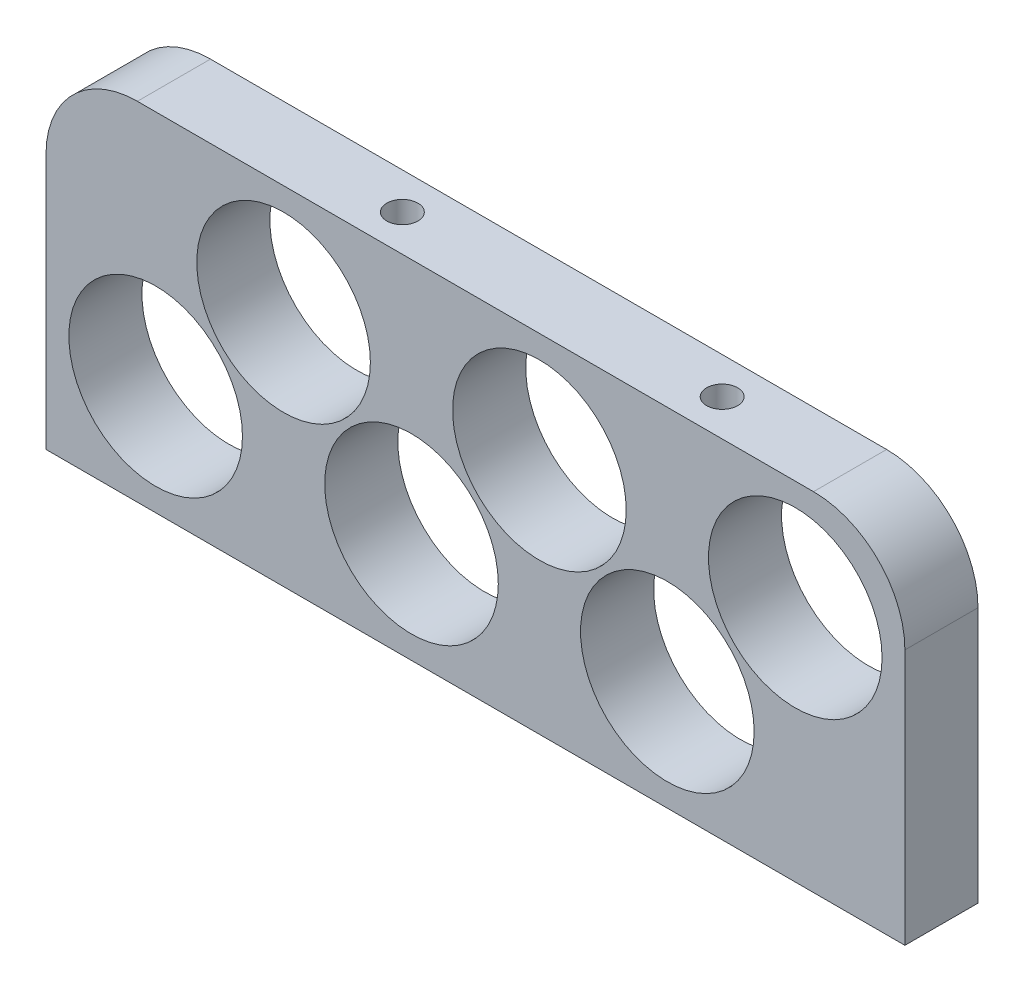
ISO-10303-21;
HEADER;
FILE_DESCRIPTION(('STEP AP214'),'2;1');
FILE_NAME('part.step','',(''),(''),'','','');
FILE_SCHEMA(('AUTOMOTIVE_DESIGN { 1 0 10303 214 1 1 1 1 }'));
ENDSEC;
DATA;
#1=APPLICATION_CONTEXT('core data for automotive mechanical design processes');
#2=APPLICATION_PROTOCOL_DEFINITION('international standard','automotive_design',2000,#1);
#3=PRODUCT_CONTEXT('',#1,'mechanical');
#4=PRODUCT('Part','Part','',(#3));
#5=PRODUCT_RELATED_PRODUCT_CATEGORY('part','',(#4));
#6=PRODUCT_DEFINITION_FORMATION('','',#4);
#7=PRODUCT_DEFINITION_CONTEXT('part definition',#1,'design');
#8=PRODUCT_DEFINITION('design','',#6,#7);
#9=PRODUCT_DEFINITION_SHAPE('','',#8);
#10=(LENGTH_UNIT() NAMED_UNIT(*) SI_UNIT(.MILLI.,.METRE.));
#11=(NAMED_UNIT(*) PLANE_ANGLE_UNIT() SI_UNIT($,.RADIAN.));
#12=(NAMED_UNIT(*) SI_UNIT($,.STERADIAN.) SOLID_ANGLE_UNIT());
#13=UNCERTAINTY_MEASURE_WITH_UNIT(LENGTH_MEASURE(1.E-05),#10,'distance_accuracy_value','');
#14=(GEOMETRIC_REPRESENTATION_CONTEXT(3) GLOBAL_UNCERTAINTY_ASSIGNED_CONTEXT((#13)) GLOBAL_UNIT_ASSIGNED_CONTEXT((#10,
#11,#12)) REPRESENTATION_CONTEXT('',''));
#15=CARTESIAN_POINT('',(0.,0.,0.));
#16=DIRECTION('',(0.,0.,1.));
#17=DIRECTION('',(1.,0.,0.));
#18=AXIS2_PLACEMENT_3D('',#15,#16,#17);
#19=CARTESIAN_POINT('',(0.,0.,8.));
#20=DIRECTION('',(0.,0.,1.));
#21=DIRECTION('',(1.,0.,0.));
#22=AXIS2_PLACEMENT_3D('',#19,#20,#21);
#23=PLANE('',#22);
#24=CARTESIAN_POINT('',(-116.821569614031,27.9917719312551,8.));
#25=DIRECTION('',(0.,0.,1.));
#26=DIRECTION('',(1.,0.,0.));
#27=AXIS2_PLACEMENT_3D('',#24,#25,#26);
#28=CIRCLE('',#27,9.49999999999999);
#29=CARTESIAN_POINT('',(-107.321569614031,27.9917719312551,8.));
#30=VERTEX_POINT('',#29);
#31=EDGE_CURVE('E199',#30,#30,#28,.T.);
#32=ORIENTED_EDGE('',*,*,#31,.F.);
#33=EDGE_LOOP('',(#32));
#34=FACE_BOUND('',#33,.T.);
#35=CARTESIAN_POINT('',(-130.821569614031,13.9917719312551,8.));
#36=DIRECTION('',(0.,0.,1.));
#37=DIRECTION('',(1.,0.,0.));
#38=AXIS2_PLACEMENT_3D('',#35,#36,#37);
#39=CIRCLE('',#38,9.50000000000001);
#40=CARTESIAN_POINT('',(-121.321569614031,13.9917719312551,8.));
#41=VERTEX_POINT('',#40);
#42=EDGE_CURVE('E183',#41,#41,#39,.T.);
#43=ORIENTED_EDGE('',*,*,#42,.F.);
#44=EDGE_LOOP('',(#43));
#45=FACE_BOUND('',#44,.T.);
#46=CARTESIAN_POINT('',(-186.821569614031,13.9917719312551,8.));
#47=DIRECTION('',(0.,0.,1.));
#48=DIRECTION('',(1.,0.,0.));
#49=AXIS2_PLACEMENT_3D('',#46,#47,#48);
#50=CIRCLE('',#49,9.50000000000001);
#51=CARTESIAN_POINT('',(-177.321569614031,13.9917719312551,8.));
#52=VERTEX_POINT('',#51);
#53=EDGE_CURVE('E167',#52,#52,#50,.T.);
#54=ORIENTED_EDGE('',*,*,#53,.F.);
#55=EDGE_LOOP('',(#54));
#56=FACE_BOUND('',#55,.T.);
#57=DIRECTION('',(0.,1.,0.));
#58=VECTOR('',#57,1.);
#59=CARTESIAN_POINT('',(-104.821569614031,39.9917719312551,8.));
#60=LINE('',#59,#58);
#61=CARTESIAN_POINT('',(-104.821569614031,1.99177193125508,8.));
#62=VERTEX_POINT('',#61);
#63=CARTESIAN_POINT('',(-104.821569614031,29.9917719312551,8.));
#64=VERTEX_POINT('',#63);
#65=EDGE_CURVE('E111',#62,#64,#60,.T.);
#66=ORIENTED_EDGE('',*,*,#65,.T.);
#67=CARTESIAN_POINT('',(-114.821569614031,29.9917719312551,8.));
#68=DIRECTION('',(0.,0.,1.));
#69=DIRECTION('',(1.,0.,0.));
#70=AXIS2_PLACEMENT_3D('',#67,#68,#69);
#71=CIRCLE('',#70,10.);
#72=CARTESIAN_POINT('',(-114.821569614031,39.9917719312551,8.));
#73=VERTEX_POINT('',#72);
#74=EDGE_CURVE('E48',#64,#73,#71,.T.);
#75=ORIENTED_EDGE('',*,*,#74,.T.);
#76=DIRECTION('',(-1.,0.,0.));
#77=VECTOR('',#76,1.);
#78=CARTESIAN_POINT('',(-198.821569614031,39.9917719312551,8.));
#79=LINE('',#78,#77);
#80=CARTESIAN_POINT('',(-188.821569614031,39.9917719312551,8.));
#81=VERTEX_POINT('',#80);
#82=EDGE_CURVE('E124',#73,#81,#79,.T.);
#83=ORIENTED_EDGE('',*,*,#82,.T.);
#84=CARTESIAN_POINT('',(-188.821569614031,29.9917719312551,8.));
#85=DIRECTION('',(0.,0.,1.));
#86=DIRECTION('',(1.,0.,0.));
#87=AXIS2_PLACEMENT_3D('',#84,#85,#86);
#88=CIRCLE('',#87,10.);
#89=CARTESIAN_POINT('',(-198.821569614031,29.9917719312551,8.));
#90=VERTEX_POINT('',#89);
#91=EDGE_CURVE('E55',#81,#90,#88,.T.);
#92=ORIENTED_EDGE('',*,*,#91,.T.);
#93=DIRECTION('',(0.,-1.,0.));
#94=VECTOR('',#93,1.);
#95=CARTESIAN_POINT('',(-198.821569614031,39.9917719312551,8.));
#96=LINE('',#95,#94);
#97=CARTESIAN_POINT('',(-198.821569614031,1.99177193125508,8.));
#98=VERTEX_POINT('',#97);
#99=EDGE_CURVE('E93',#90,#98,#96,.T.);
#100=ORIENTED_EDGE('',*,*,#99,.T.);
#101=DIRECTION('',(1.,0.,0.));
#102=VECTOR('',#101,1.);
#103=CARTESIAN_POINT('',(-198.821569614031,1.99177193125508,8.));
#104=LINE('',#103,#102);
#105=EDGE_CURVE('E96',#98,#62,#104,.T.);
#106=ORIENTED_EDGE('',*,*,#105,.T.);
#107=EDGE_LOOP('',(#66,#75,#83,#92,#100,#106));
#108=FACE_BOUND('',#107,.T.);
#109=CARTESIAN_POINT('',(-158.821569614031,13.9917719312551,8.));
#110=DIRECTION('',(0.,0.,1.));
#111=DIRECTION('',(1.,0.,0.));
#112=AXIS2_PLACEMENT_3D('',#109,#110,#111);
#113=CIRCLE('',#112,9.50000000000001);
#114=CARTESIAN_POINT('',(-149.321569614031,13.9917719312551,8.));
#115=VERTEX_POINT('',#114);
#116=EDGE_CURVE('E175',#115,#115,#113,.T.);
#117=ORIENTED_EDGE('',*,*,#116,.F.);
#118=EDGE_LOOP('',(#117));
#119=FACE_BOUND('',#118,.T.);
#120=CARTESIAN_POINT('',(-144.821569614031,27.9917719312551,8.));
#121=DIRECTION('',(0.,0.,1.));
#122=DIRECTION('',(1.,0.,0.));
#123=AXIS2_PLACEMENT_3D('',#120,#121,#122);
#124=CIRCLE('',#123,9.50000000000001);
#125=CARTESIAN_POINT('',(-135.321569614031,27.9917719312551,8.));
#126=VERTEX_POINT('',#125);
#127=EDGE_CURVE('E191',#126,#126,#124,.T.);
#128=ORIENTED_EDGE('',*,*,#127,.F.);
#129=EDGE_LOOP('',(#128));
#130=FACE_BOUND('',#129,.T.);
#131=CARTESIAN_POINT('',(-172.821569614031,27.9917719312551,8.));
#132=DIRECTION('',(0.,0.,1.));
#133=DIRECTION('',(1.,0.,0.));
#134=AXIS2_PLACEMENT_3D('',#131,#132,#133);
#135=CIRCLE('',#134,9.50000000000001);
#136=CARTESIAN_POINT('',(-163.321569614031,27.9917719312551,8.));
#137=VERTEX_POINT('',#136);
#138=EDGE_CURVE('E207',#137,#137,#135,.T.);
#139=ORIENTED_EDGE('',*,*,#138,.F.);
#140=EDGE_LOOP('',(#139));
#141=FACE_BOUND('',#140,.T.);
#142=ADVANCED_FACE('F39',(#34,#45,#56,#108,#119,#130,#141),#23,.T.);
#143=CARTESIAN_POINT('',(0.,0.,0.));
#144=DIRECTION('',(0.,0.,1.));
#145=DIRECTION('',(1.,0.,0.));
#146=AXIS2_PLACEMENT_3D('',#143,#144,#145);
#147=PLANE('',#146);
#148=DIRECTION('',(-1.,0.,0.));
#149=VECTOR('',#148,1.);
#150=CARTESIAN_POINT('',(-198.821569614031,39.9917719312551,0.));
#151=LINE('',#150,#149);
#152=CARTESIAN_POINT('',(-114.821569614031,39.9917719312551,0.));
#153=VERTEX_POINT('',#152);
#154=CARTESIAN_POINT('',(-188.821569614031,39.9917719312551,0.));
#155=VERTEX_POINT('',#154);
#156=EDGE_CURVE('E102',#153,#155,#151,.T.);
#157=ORIENTED_EDGE('',*,*,#156,.F.);
#158=CARTESIAN_POINT('',(-114.821569614031,29.9917719312551,0.));
#159=DIRECTION('',(0.,0.,1.));
#160=DIRECTION('',(1.,0.,0.));
#161=AXIS2_PLACEMENT_3D('',#158,#159,#160);
#162=CIRCLE('',#161,10.);
#163=CARTESIAN_POINT('',(-104.821569614031,29.9917719312551,0.));
#164=VERTEX_POINT('',#163);
#165=EDGE_CURVE('E134',#153,#164,#162,.F.);
#166=ORIENTED_EDGE('',*,*,#165,.T.);
#167=DIRECTION('',(0.,1.,0.));
#168=VECTOR('',#167,1.);
#169=CARTESIAN_POINT('',(-104.821569614031,39.9917719312551,0.));
#170=LINE('',#169,#168);
#171=CARTESIAN_POINT('',(-104.821569614031,1.99177193125508,0.));
#172=VERTEX_POINT('',#171);
#173=EDGE_CURVE('E157',#172,#164,#170,.T.);
#174=ORIENTED_EDGE('',*,*,#173,.F.);
#175=DIRECTION('',(1.,0.,0.));
#176=VECTOR('',#175,1.);
#177=CARTESIAN_POINT('',(-198.821569614031,1.99177193125508,0.));
#178=LINE('',#177,#176);
#179=CARTESIAN_POINT('',(-198.821569614031,1.99177193125508,0.));
#180=VERTEX_POINT('',#179);
#181=EDGE_CURVE('E160',#180,#172,#178,.T.);
#182=ORIENTED_EDGE('',*,*,#181,.F.);
#183=DIRECTION('',(0.,-1.,0.));
#184=VECTOR('',#183,1.);
#185=CARTESIAN_POINT('',(-198.821569614031,39.9917719312551,0.));
#186=LINE('',#185,#184);
#187=CARTESIAN_POINT('',(-198.821569614031,29.9917719312551,0.));
#188=VERTEX_POINT('',#187);
#189=EDGE_CURVE('E115',#188,#180,#186,.T.);
#190=ORIENTED_EDGE('',*,*,#189,.F.);
#191=CARTESIAN_POINT('',(-188.821569614031,29.9917719312551,0.));
#192=DIRECTION('',(0.,0.,1.));
#193=DIRECTION('',(1.,0.,0.));
#194=AXIS2_PLACEMENT_3D('',#191,#192,#193);
#195=CIRCLE('',#194,10.);
#196=EDGE_CURVE('E131',#188,#155,#195,.F.);
#197=ORIENTED_EDGE('',*,*,#196,.T.);
#198=EDGE_LOOP('',(#157,#166,#174,#182,#190,#197));
#199=FACE_BOUND('',#198,.T.);
#200=CARTESIAN_POINT('',(-186.821569614031,13.9917719312551,0.));
#201=DIRECTION('',(0.,0.,1.));
#202=DIRECTION('',(1.,0.,0.));
#203=AXIS2_PLACEMENT_3D('',#200,#201,#202);
#204=CIRCLE('',#203,9.50000000000001);
#205=CARTESIAN_POINT('',(-177.321569614031,13.9917719312551,0.));
#206=VERTEX_POINT('',#205);
#207=EDGE_CURVE('E171',#206,#206,#204,.T.);
#208=ORIENTED_EDGE('',*,*,#207,.T.);
#209=EDGE_LOOP('',(#208));
#210=FACE_BOUND('',#209,.T.);
#211=CARTESIAN_POINT('',(-158.821569614031,13.9917719312551,0.));
#212=DIRECTION('',(0.,0.,1.));
#213=DIRECTION('',(1.,0.,0.));
#214=AXIS2_PLACEMENT_3D('',#211,#212,#213);
#215=CIRCLE('',#214,9.50000000000001);
#216=CARTESIAN_POINT('',(-149.321569614031,13.9917719312551,0.));
#217=VERTEX_POINT('',#216);
#218=EDGE_CURVE('E179',#217,#217,#215,.T.);
#219=ORIENTED_EDGE('',*,*,#218,.T.);
#220=EDGE_LOOP('',(#219));
#221=FACE_BOUND('',#220,.T.);
#222=CARTESIAN_POINT('',(-130.821569614031,13.9917719312551,0.));
#223=DIRECTION('',(0.,0.,1.));
#224=DIRECTION('',(1.,0.,0.));
#225=AXIS2_PLACEMENT_3D('',#222,#223,#224);
#226=CIRCLE('',#225,9.50000000000001);
#227=CARTESIAN_POINT('',(-121.321569614031,13.9917719312551,0.));
#228=VERTEX_POINT('',#227);
#229=EDGE_CURVE('E187',#228,#228,#226,.T.);
#230=ORIENTED_EDGE('',*,*,#229,.T.);
#231=EDGE_LOOP('',(#230));
#232=FACE_BOUND('',#231,.T.);
#233=CARTESIAN_POINT('',(-144.821569614031,27.9917719312551,0.));
#234=DIRECTION('',(0.,0.,1.));
#235=DIRECTION('',(1.,0.,0.));
#236=AXIS2_PLACEMENT_3D('',#233,#234,#235);
#237=CIRCLE('',#236,9.50000000000001);
#238=CARTESIAN_POINT('',(-135.321569614031,27.9917719312551,0.));
#239=VERTEX_POINT('',#238);
#240=EDGE_CURVE('E195',#239,#239,#237,.T.);
#241=ORIENTED_EDGE('',*,*,#240,.T.);
#242=EDGE_LOOP('',(#241));
#243=FACE_BOUND('',#242,.T.);
#244=CARTESIAN_POINT('',(-116.821569614031,27.9917719312551,0.));
#245=DIRECTION('',(0.,0.,1.));
#246=DIRECTION('',(1.,0.,0.));
#247=AXIS2_PLACEMENT_3D('',#244,#245,#246);
#248=CIRCLE('',#247,9.49999999999999);
#249=CARTESIAN_POINT('',(-107.321569614031,27.9917719312551,0.));
#250=VERTEX_POINT('',#249);
#251=EDGE_CURVE('E203',#250,#250,#248,.T.);
#252=ORIENTED_EDGE('',*,*,#251,.T.);
#253=EDGE_LOOP('',(#252));
#254=FACE_BOUND('',#253,.T.);
#255=CARTESIAN_POINT('',(-172.821569614031,27.9917719312551,0.));
#256=DIRECTION('',(0.,0.,1.));
#257=DIRECTION('',(1.,0.,0.));
#258=AXIS2_PLACEMENT_3D('',#255,#256,#257);
#259=CIRCLE('',#258,9.50000000000001);
#260=CARTESIAN_POINT('',(-163.321569614031,27.9917719312551,0.));
#261=VERTEX_POINT('',#260);
#262=EDGE_CURVE('E211',#261,#261,#259,.T.);
#263=ORIENTED_EDGE('',*,*,#262,.T.);
#264=EDGE_LOOP('',(#263));
#265=FACE_BOUND('',#264,.T.);
#266=ADVANCED_FACE('F155',(#199,#210,#221,#232,#243,#254,#265),#147,.F.);
#267=CARTESIAN_POINT('',(-198.821569614031,39.9917719312551,8.));
#268=DIRECTION('',(1.,0.,0.));
#269=DIRECTION('',(0.,0.,-1.));
#270=AXIS2_PLACEMENT_3D('',#267,#268,#269);
#271=PLANE('',#270);
#272=ORIENTED_EDGE('',*,*,#99,.F.);
#273=DIRECTION('',(0.,0.,-1.));
#274=VECTOR('',#273,1.);
#275=CARTESIAN_POINT('',(-198.821569614031,29.9917719312551,8.));
#276=LINE('',#275,#274);
#277=EDGE_CURVE('E11',#90,#188,#276,.T.);
#278=ORIENTED_EDGE('',*,*,#277,.T.);
#279=ORIENTED_EDGE('',*,*,#189,.T.);
#280=DIRECTION('',(0.,0.,-1.));
#281=VECTOR('',#280,1.);
#282=CARTESIAN_POINT('',(-198.821569614031,1.99177193125508,8.));
#283=LINE('',#282,#281);
#284=EDGE_CURVE('E107',#98,#180,#283,.T.);
#285=ORIENTED_EDGE('',*,*,#284,.F.);
#286=EDGE_LOOP('',(#272,#278,#279,#285));
#287=FACE_BOUND('',#286,.T.);
#288=ADVANCED_FACE('F113',(#287),#271,.F.);
#289=CARTESIAN_POINT('',(-198.821569614031,1.99177193125508,8.));
#290=DIRECTION('',(0.,1.,0.));
#291=DIRECTION('',(0.,0.,1.));
#292=AXIS2_PLACEMENT_3D('',#289,#290,#291);
#293=PLANE('',#292);
#294=ORIENTED_EDGE('',*,*,#181,.T.);
#295=DIRECTION('',(0.,0.,-1.));
#296=VECTOR('',#295,1.);
#297=CARTESIAN_POINT('',(-104.821569614031,1.99177193125508,8.));
#298=LINE('',#297,#296);
#299=EDGE_CURVE('E109',#62,#172,#298,.T.);
#300=ORIENTED_EDGE('',*,*,#299,.F.);
#301=ORIENTED_EDGE('',*,*,#105,.F.);
#302=ORIENTED_EDGE('',*,*,#284,.T.);
#303=EDGE_LOOP('',(#294,#300,#301,#302));
#304=FACE_BOUND('',#303,.T.);
#305=ADVANCED_FACE('F106',(#304),#293,.F.);
#306=CARTESIAN_POINT('',(-104.821569614031,39.9917719312551,8.));
#307=DIRECTION('',(-1.,0.,0.));
#308=DIRECTION('',(0.,0.,1.));
#309=AXIS2_PLACEMENT_3D('',#306,#307,#308);
#310=PLANE('',#309);
#311=ORIENTED_EDGE('',*,*,#173,.T.);
#312=DIRECTION('',(0.,0.,-1.));
#313=VECTOR('',#312,1.);
#314=CARTESIAN_POINT('',(-104.821569614031,29.9917719312551,8.));
#315=LINE('',#314,#313);
#316=EDGE_CURVE('E63',#164,#64,#315,.F.);
#317=ORIENTED_EDGE('',*,*,#316,.T.);
#318=ORIENTED_EDGE('',*,*,#65,.F.);
#319=ORIENTED_EDGE('',*,*,#299,.T.);
#320=EDGE_LOOP('',(#311,#317,#318,#319));
#321=FACE_BOUND('',#320,.T.);
#322=ADVANCED_FACE('F158',(#321),#310,.F.);
#323=CARTESIAN_POINT('',(-198.821569614031,39.9917719312551,8.));
#324=DIRECTION('',(0.,-1.,0.));
#325=DIRECTION('',(0.,0.,-1.));
#326=AXIS2_PLACEMENT_3D('',#323,#324,#325);
#327=PLANE('',#326);
#328=CARTESIAN_POINT('',(-163.821569614031,39.9917719312551,4.));
#329=DIRECTION('',(0.,1.,0.));
#330=DIRECTION('',(0.,0.,1.));
#331=AXIS2_PLACEMENT_3D('',#328,#329,#330);
#332=CIRCLE('',#331,1.70000000000001);
#333=CARTESIAN_POINT('',(-163.821569614031,39.9917719312551,5.70000000000001));
#334=VERTEX_POINT('',#333);
#335=EDGE_CURVE('E227',#334,#334,#332,.T.);
#336=ORIENTED_EDGE('',*,*,#335,.F.);
#337=EDGE_LOOP('',(#336));
#338=FACE_BOUND('',#337,.T.);
#339=CARTESIAN_POINT('',(-128.821569614031,39.9917719312551,4.));
#340=DIRECTION('',(0.,1.,0.));
#341=DIRECTION('',(0.,0.,1.));
#342=AXIS2_PLACEMENT_3D('',#339,#340,#341);
#343=CIRCLE('',#342,1.70000000000001);
#344=CARTESIAN_POINT('',(-128.821569614031,39.9917719312551,5.70000000000001));
#345=VERTEX_POINT('',#344);
#346=EDGE_CURVE('E219',#345,#345,#343,.T.);
#347=ORIENTED_EDGE('',*,*,#346,.F.);
#348=EDGE_LOOP('',(#347));
#349=FACE_BOUND('',#348,.T.);
#350=ORIENTED_EDGE('',*,*,#82,.F.);
#351=DIRECTION('',(0.,0.,-1.));
#352=VECTOR('',#351,1.);
#353=CARTESIAN_POINT('',(-114.821569614031,39.9917719312551,8.));
#354=LINE('',#353,#352);
#355=EDGE_CURVE('E122',#73,#153,#354,.T.);
#356=ORIENTED_EDGE('',*,*,#355,.T.);
#357=ORIENTED_EDGE('',*,*,#156,.T.);
#358=DIRECTION('',(0.,0.,-1.));
#359=VECTOR('',#358,1.);
#360=CARTESIAN_POINT('',(-188.821569614031,39.9917719312551,8.));
#361=LINE('',#360,#359);
#362=EDGE_CURVE('E118',#155,#81,#361,.F.);
#363=ORIENTED_EDGE('',*,*,#362,.T.);
#364=EDGE_LOOP('',(#350,#356,#357,#363));
#365=FACE_BOUND('',#364,.T.);
#366=ADVANCED_FACE('F146',(#338,#349,#365),#327,.F.);
#367=CARTESIAN_POINT('',(-186.821569614031,13.9917719312551,8.));
#368=DIRECTION('',(0.,0.,-1.));
#369=DIRECTION('',(-1.,0.,0.));
#370=AXIS2_PLACEMENT_3D('',#367,#368,#369);
#371=CYLINDRICAL_SURFACE('',#370,9.50000000000001);
#372=ORIENTED_EDGE('',*,*,#53,.T.);
#373=EDGE_LOOP('',(#372));
#374=FACE_BOUND('',#373,.T.);
#375=ORIENTED_EDGE('',*,*,#207,.F.);
#376=EDGE_LOOP('',(#375));
#377=FACE_BOUND('',#376,.T.);
#378=ADVANCED_FACE('F246',(#374,#377),#371,.F.);
#379=CARTESIAN_POINT('',(-158.821569614031,13.9917719312551,8.));
#380=DIRECTION('',(0.,0.,-1.));
#381=DIRECTION('',(-1.,0.,0.));
#382=AXIS2_PLACEMENT_3D('',#379,#380,#381);
#383=CYLINDRICAL_SURFACE('',#382,9.50000000000001);
#384=ORIENTED_EDGE('',*,*,#116,.T.);
#385=EDGE_LOOP('',(#384));
#386=FACE_BOUND('',#385,.T.);
#387=ORIENTED_EDGE('',*,*,#218,.F.);
#388=EDGE_LOOP('',(#387));
#389=FACE_BOUND('',#388,.T.);
#390=ADVANCED_FACE('F300',(#386,#389),#383,.F.);
#391=CARTESIAN_POINT('',(-130.821569614031,13.9917719312551,8.));
#392=DIRECTION('',(0.,0.,-1.));
#393=DIRECTION('',(-1.,0.,0.));
#394=AXIS2_PLACEMENT_3D('',#391,#392,#393);
#395=CYLINDRICAL_SURFACE('',#394,9.50000000000001);
#396=ORIENTED_EDGE('',*,*,#42,.T.);
#397=EDGE_LOOP('',(#396));
#398=FACE_BOUND('',#397,.T.);
#399=ORIENTED_EDGE('',*,*,#229,.F.);
#400=EDGE_LOOP('',(#399));
#401=FACE_BOUND('',#400,.T.);
#402=ADVANCED_FACE('F297',(#398,#401),#395,.F.);
#403=CARTESIAN_POINT('',(-144.821569614031,27.9917719312551,8.));
#404=DIRECTION('',(0.,0.,-1.));
#405=DIRECTION('',(-1.,0.,0.));
#406=AXIS2_PLACEMENT_3D('',#403,#404,#405);
#407=CYLINDRICAL_SURFACE('',#406,9.50000000000001);
#408=ORIENTED_EDGE('',*,*,#127,.T.);
#409=EDGE_LOOP('',(#408));
#410=FACE_BOUND('',#409,.T.);
#411=ORIENTED_EDGE('',*,*,#240,.F.);
#412=EDGE_LOOP('',(#411));
#413=FACE_BOUND('',#412,.T.);
#414=ADVANCED_FACE('F290',(#410,#413),#407,.F.);
#415=CARTESIAN_POINT('',(-116.821569614031,27.9917719312551,8.));
#416=DIRECTION('',(0.,0.,-1.));
#417=DIRECTION('',(-1.,0.,0.));
#418=AXIS2_PLACEMENT_3D('',#415,#416,#417);
#419=CYLINDRICAL_SURFACE('',#418,9.49999999999999);
#420=ORIENTED_EDGE('',*,*,#31,.T.);
#421=EDGE_LOOP('',(#420));
#422=FACE_BOUND('',#421,.T.);
#423=ORIENTED_EDGE('',*,*,#251,.F.);
#424=EDGE_LOOP('',(#423));
#425=FACE_BOUND('',#424,.T.);
#426=ADVANCED_FACE('F285',(#422,#425),#419,.F.);
#427=CARTESIAN_POINT('',(-172.821569614031,27.9917719312551,8.));
#428=DIRECTION('',(0.,0.,-1.));
#429=DIRECTION('',(-1.,0.,0.));
#430=AXIS2_PLACEMENT_3D('',#427,#428,#429);
#431=CYLINDRICAL_SURFACE('',#430,9.50000000000001);
#432=ORIENTED_EDGE('',*,*,#138,.T.);
#433=EDGE_LOOP('',(#432));
#434=FACE_BOUND('',#433,.T.);
#435=ORIENTED_EDGE('',*,*,#262,.F.);
#436=EDGE_LOOP('',(#435));
#437=FACE_BOUND('',#436,.T.);
#438=ADVANCED_FACE('F281',(#434,#437),#431,.F.);
#439=CARTESIAN_POINT('',(-114.821569614031,29.9917719312551,8.));
#440=DIRECTION('',(0.,0.,-1.));
#441=DIRECTION('',(-1.,0.,0.));
#442=AXIS2_PLACEMENT_3D('',#439,#440,#441);
#443=CYLINDRICAL_SURFACE('',#442,10.);
#444=ORIENTED_EDGE('',*,*,#74,.F.);
#445=ORIENTED_EDGE('',*,*,#316,.F.);
#446=ORIENTED_EDGE('',*,*,#165,.F.);
#447=ORIENTED_EDGE('',*,*,#355,.F.);
#448=EDGE_LOOP('',(#444,#445,#446,#447));
#449=FACE_BOUND('',#448,.T.);
#450=ADVANCED_FACE('F152',(#449),#443,.T.);
#451=CARTESIAN_POINT('',(-188.821569614031,29.9917719312551,8.));
#452=DIRECTION('',(0.,0.,-1.));
#453=DIRECTION('',(-1.,0.,0.));
#454=AXIS2_PLACEMENT_3D('',#451,#452,#453);
#455=CYLINDRICAL_SURFACE('',#454,10.);
#456=ORIENTED_EDGE('',*,*,#91,.F.);
#457=ORIENTED_EDGE('',*,*,#362,.F.);
#458=ORIENTED_EDGE('',*,*,#196,.F.);
#459=ORIENTED_EDGE('',*,*,#277,.F.);
#460=EDGE_LOOP('',(#456,#457,#458,#459));
#461=FACE_BOUND('',#460,.T.);
#462=ADVANCED_FACE('F41',(#461),#455,.T.);
#463=CARTESIAN_POINT('',(-128.821569614031,34.9917719312551,4.));
#464=DIRECTION('',(0.,1.,0.));
#465=DIRECTION('',(0.,0.,1.));
#466=AXIS2_PLACEMENT_3D('',#463,#464,#465);
#467=CYLINDRICAL_SURFACE('',#466,1.70000000000001);
#468=CARTESIAN_POINT('',(-128.821569614031,34.9917719312551,4.));
#469=DIRECTION('',(0.,1.,0.));
#470=DIRECTION('',(0.,0.,1.));
#471=AXIS2_PLACEMENT_3D('',#468,#469,#470);
#472=CIRCLE('',#471,1.70000000000001);
#473=CARTESIAN_POINT('',(-128.821569614031,34.9917719312551,5.70000000000001));
#474=VERTEX_POINT('',#473);
#475=EDGE_CURVE('E223',#474,#474,#472,.T.);
#476=ORIENTED_EDGE('',*,*,#475,.F.);
#477=EDGE_LOOP('',(#476));
#478=FACE_BOUND('',#477,.T.);
#479=ORIENTED_EDGE('',*,*,#346,.T.);
#480=EDGE_LOOP('',(#479));
#481=FACE_BOUND('',#480,.T.);
#482=ADVANCED_FACE('F250',(#478,#481),#467,.F.);
#483=CARTESIAN_POINT('',(-128.821569614031,34.9917719312551,4.));
#484=DIRECTION('',(0.,1.,0.));
#485=DIRECTION('',(0.,0.,1.));
#486=AXIS2_PLACEMENT_3D('',#483,#484,#485);
#487=PLANE('',#486);
#488=ORIENTED_EDGE('',*,*,#475,.T.);
#489=EDGE_LOOP('',(#488));
#490=FACE_BOUND('',#489,.T.);
#491=ADVANCED_FACE('F240',(#490),#487,.T.);
#492=CARTESIAN_POINT('',(-163.821569614031,34.9917719312551,4.));
#493=DIRECTION('',(0.,1.,0.));
#494=DIRECTION('',(0.,0.,1.));
#495=AXIS2_PLACEMENT_3D('',#492,#493,#494);
#496=CYLINDRICAL_SURFACE('',#495,1.70000000000001);
#497=CARTESIAN_POINT('',(-163.821569614031,34.9917719312551,4.));
#498=DIRECTION('',(0.,1.,0.));
#499=DIRECTION('',(0.,0.,1.));
#500=AXIS2_PLACEMENT_3D('',#497,#498,#499);
#501=CIRCLE('',#500,1.70000000000001);
#502=CARTESIAN_POINT('',(-163.821569614031,34.9917719312551,5.70000000000001));
#503=VERTEX_POINT('',#502);
#504=EDGE_CURVE('E215',#503,#503,#501,.T.);
#505=ORIENTED_EDGE('',*,*,#504,.F.);
#506=EDGE_LOOP('',(#505));
#507=FACE_BOUND('',#506,.T.);
#508=ORIENTED_EDGE('',*,*,#335,.T.);
#509=EDGE_LOOP('',(#508));
#510=FACE_BOUND('',#509,.T.);
#511=ADVANCED_FACE('F237',(#507,#510),#496,.F.);
#512=CARTESIAN_POINT('',(-163.821569614031,34.9917719312551,4.));
#513=DIRECTION('',(0.,1.,0.));
#514=DIRECTION('',(0.,0.,1.));
#515=AXIS2_PLACEMENT_3D('',#512,#513,#514);
#516=PLANE('',#515);
#517=ORIENTED_EDGE('',*,*,#504,.T.);
#518=EDGE_LOOP('',(#517));
#519=FACE_BOUND('',#518,.T.);
#520=ADVANCED_FACE('F235',(#519),#516,.T.);
#521=CLOSED_SHELL('',(#142,#266,#288,#305,#322,#366,#378,#390,#402,#414,#426,#438,#450,#462,
#482,#491,#511,#520));
#522=MANIFOLD_SOLID_BREP('B2',#521);
#523=ADVANCED_BREP_SHAPE_REPRESENTATION('',(#18,#522),#14);
#524=SHAPE_DEFINITION_REPRESENTATION(#9,#523);
ENDSEC;
END-ISO-10303-21;
